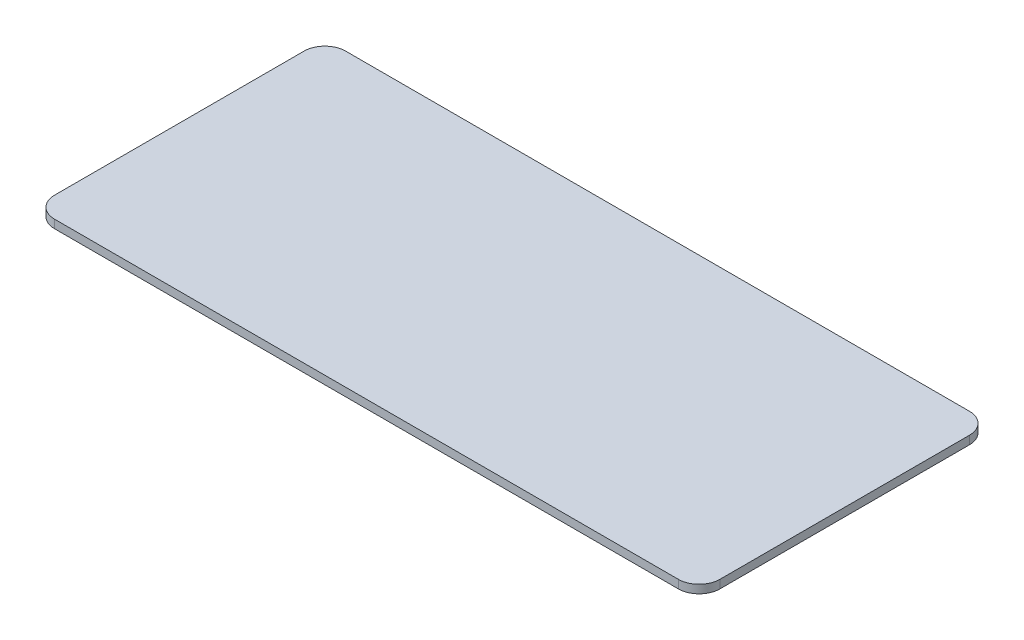
ISO-10303-21;
HEADER;
FILE_DESCRIPTION(('STEP AP214'),'2;1');
FILE_NAME('part.step','',(''),(''),'','','');
FILE_SCHEMA(('AUTOMOTIVE_DESIGN { 1 0 10303 214 1 1 1 1 }'));
ENDSEC;
DATA;
#1=APPLICATION_CONTEXT('core data for automotive mechanical design processes');
#2=APPLICATION_PROTOCOL_DEFINITION('international standard','automotive_design',2000,#1);
#3=PRODUCT_CONTEXT('',#1,'mechanical');
#4=PRODUCT('Part','Part','',(#3));
#5=PRODUCT_RELATED_PRODUCT_CATEGORY('part','',(#4));
#6=PRODUCT_DEFINITION_FORMATION('','',#4);
#7=PRODUCT_DEFINITION_CONTEXT('part definition',#1,'design');
#8=PRODUCT_DEFINITION('design','',#6,#7);
#9=PRODUCT_DEFINITION_SHAPE('','',#8);
#10=(LENGTH_UNIT() NAMED_UNIT(*) SI_UNIT(.MILLI.,.METRE.));
#11=(NAMED_UNIT(*) PLANE_ANGLE_UNIT() SI_UNIT($,.RADIAN.));
#12=(NAMED_UNIT(*) SI_UNIT($,.STERADIAN.) SOLID_ANGLE_UNIT());
#13=UNCERTAINTY_MEASURE_WITH_UNIT(LENGTH_MEASURE(1.E-05),#10,'distance_accuracy_value','');
#14=(GEOMETRIC_REPRESENTATION_CONTEXT(3) GLOBAL_UNCERTAINTY_ASSIGNED_CONTEXT((#13)) GLOBAL_UNIT_ASSIGNED_CONTEXT((#10,
#11,#12)) REPRESENTATION_CONTEXT('',''));
#15=CARTESIAN_POINT('',(0.,0.,0.));
#16=DIRECTION('',(0.,0.,1.));
#17=DIRECTION('',(1.,0.,0.));
#18=AXIS2_PLACEMENT_3D('',#15,#16,#17);
#19=CARTESIAN_POINT('',(0.,48.,0.));
#20=DIRECTION('',(0.,1.,0.));
#21=DIRECTION('',(0.,0.,1.));
#22=AXIS2_PLACEMENT_3D('',#19,#20,#21);
#23=PLANE('',#22);
#24=CARTESIAN_POINT('',(-93.3544303797468,48.,-42.8481012658228));
#25=DIRECTION('',(0.,1.,0.));
#26=DIRECTION('',(0.,0.,1.));
#27=AXIS2_PLACEMENT_3D('',#24,#25,#26);
#28=CIRCLE('',#27,5.);
#29=CARTESIAN_POINT('',(-98.3544303797468,48.,-42.8481012658228));
#30=VERTEX_POINT('',#29);
#31=CARTESIAN_POINT('',(-93.3544303797468,48.,-47.8481012658228));
#32=VERTEX_POINT('',#31);
#33=EDGE_CURVE('E131',#30,#32,#28,.F.);
#34=ORIENTED_EDGE('',*,*,#33,.T.);
#35=DIRECTION('',(-1.,0.,0.));
#36=VECTOR('',#35,1.);
#37=CARTESIAN_POINT('',(-98.3544303797468,48.,-47.8481012658228));
#38=LINE('',#37,#36);
#39=CARTESIAN_POINT('',(56.6455696202532,48.,-47.8481012658228));
#40=VERTEX_POINT('',#39);
#41=EDGE_CURVE('E134',#40,#32,#38,.T.);
#42=ORIENTED_EDGE('',*,*,#41,.F.);
#43=CARTESIAN_POINT('',(56.6455696202532,48.,-42.8481012658228));
#44=DIRECTION('',(0.,1.,0.));
#45=DIRECTION('',(0.,0.,1.));
#46=AXIS2_PLACEMENT_3D('',#43,#44,#45);
#47=CIRCLE('',#46,5.);
#48=CARTESIAN_POINT('',(61.6455696202532,48.,-42.8481012658228));
#49=VERTEX_POINT('',#48);
#50=EDGE_CURVE('E118',#40,#49,#47,.F.);
#51=ORIENTED_EDGE('',*,*,#50,.T.);
#52=DIRECTION('',(0.,0.,-1.));
#53=VECTOR('',#52,1.);
#54=CARTESIAN_POINT('',(61.6455696202532,48.,-47.8481012658228));
#55=LINE('',#54,#53);
#56=CARTESIAN_POINT('',(61.6455696202532,48.,17.1518987341772));
#57=VERTEX_POINT('',#56);
#58=EDGE_CURVE('E114',#57,#49,#55,.T.);
#59=ORIENTED_EDGE('',*,*,#58,.F.);
#60=CARTESIAN_POINT('',(56.6455696202532,48.,17.1518987341772));
#61=DIRECTION('',(0.,1.,0.));
#62=DIRECTION('',(0.,0.,1.));
#63=AXIS2_PLACEMENT_3D('',#60,#61,#62);
#64=CIRCLE('',#63,5.);
#65=CARTESIAN_POINT('',(56.6455696202532,48.,22.1518987341772));
#66=VERTEX_POINT('',#65);
#67=EDGE_CURVE('E39',#57,#66,#64,.F.);
#68=ORIENTED_EDGE('',*,*,#67,.T.);
#69=DIRECTION('',(1.,0.,0.));
#70=VECTOR('',#69,1.);
#71=CARTESIAN_POINT('',(-98.3544303797468,48.,22.1518987341772));
#72=LINE('',#71,#70);
#73=CARTESIAN_POINT('',(-93.3544303797468,48.,22.1518987341772));
#74=VERTEX_POINT('',#73);
#75=EDGE_CURVE('E101',#74,#66,#72,.T.);
#76=ORIENTED_EDGE('',*,*,#75,.F.);
#77=CARTESIAN_POINT('',(-93.3544303797468,48.,17.1518987341772));
#78=DIRECTION('',(0.,1.,0.));
#79=DIRECTION('',(0.,0.,1.));
#80=AXIS2_PLACEMENT_3D('',#77,#78,#79);
#81=CIRCLE('',#80,5.);
#82=CARTESIAN_POINT('',(-98.3544303797468,48.,17.1518987341772));
#83=VERTEX_POINT('',#82);
#84=EDGE_CURVE('E109',#74,#83,#81,.F.);
#85=ORIENTED_EDGE('',*,*,#84,.T.);
#86=DIRECTION('',(0.,0.,1.));
#87=VECTOR('',#86,1.);
#88=CARTESIAN_POINT('',(-98.3544303797468,48.,-47.8481012658228));
#89=LINE('',#88,#87);
#90=EDGE_CURVE('E108',#30,#83,#89,.T.);
#91=ORIENTED_EDGE('',*,*,#90,.F.);
#92=EDGE_LOOP('',(#34,#42,#51,#59,#68,#76,#85,#91));
#93=FACE_BOUND('',#92,.T.);
#94=ADVANCED_FACE('F35',(#93),#23,.F.);
#95=CARTESIAN_POINT('',(-98.3544303797468,50.,22.1518987341772));
#96=DIRECTION('',(0.,0.,-1.));
#97=DIRECTION('',(-1.,0.,0.));
#98=AXIS2_PLACEMENT_3D('',#95,#96,#97);
#99=PLANE('',#98);
#100=DIRECTION('',(0.,-1.,0.));
#101=VECTOR('',#100,1.);
#102=CARTESIAN_POINT('',(-93.3544303797468,50.,22.1518987341772));
#103=LINE('',#102,#101);
#104=CARTESIAN_POINT('',(-93.3544303797468,50.,22.1518987341772));
#105=VERTEX_POINT('',#104);
#106=EDGE_CURVE('E105',#105,#74,#103,.T.);
#107=ORIENTED_EDGE('',*,*,#106,.T.);
#108=ORIENTED_EDGE('',*,*,#75,.T.);
#109=DIRECTION('',(0.,-1.,0.));
#110=VECTOR('',#109,1.);
#111=CARTESIAN_POINT('',(56.6455696202532,50.,22.1518987341772));
#112=LINE('',#111,#110);
#113=CARTESIAN_POINT('',(56.6455696202532,50.,22.1518987341772));
#114=VERTEX_POINT('',#113);
#115=EDGE_CURVE('E58',#66,#114,#112,.F.);
#116=ORIENTED_EDGE('',*,*,#115,.T.);
#117=DIRECTION('',(1.,0.,0.));
#118=VECTOR('',#117,1.);
#119=CARTESIAN_POINT('',(-98.3544303797468,50.,22.1518987341772));
#120=LINE('',#119,#118);
#121=EDGE_CURVE('E44',#105,#114,#120,.T.);
#122=ORIENTED_EDGE('',*,*,#121,.F.);
#123=EDGE_LOOP('',(#107,#108,#116,#122));
#124=FACE_BOUND('',#123,.T.);
#125=ADVANCED_FACE('F103',(#124),#99,.F.);
#126=CARTESIAN_POINT('',(-98.3544303797468,50.,-47.8481012658228));
#127=DIRECTION('',(1.,0.,0.));
#128=DIRECTION('',(0.,0.,-1.));
#129=AXIS2_PLACEMENT_3D('',#126,#127,#128);
#130=PLANE('',#129);
#131=DIRECTION('',(0.,-1.,0.));
#132=VECTOR('',#131,1.);
#133=CARTESIAN_POINT('',(-98.3544303797468,50.,-42.8481012658228));
#134=LINE('',#133,#132);
#135=CARTESIAN_POINT('',(-98.3544303797468,50.,-42.8481012658228));
#136=VERTEX_POINT('',#135);
#137=EDGE_CURVE('E126',#136,#30,#134,.T.);
#138=ORIENTED_EDGE('',*,*,#137,.T.);
#139=ORIENTED_EDGE('',*,*,#90,.T.);
#140=DIRECTION('',(0.,-1.,0.));
#141=VECTOR('',#140,1.);
#142=CARTESIAN_POINT('',(-98.3544303797468,50.,17.1518987341772));
#143=LINE('',#142,#141);
#144=CARTESIAN_POINT('',(-98.3544303797468,50.,17.1518987341772));
#145=VERTEX_POINT('',#144);
#146=EDGE_CURVE('E155',#83,#145,#143,.F.);
#147=ORIENTED_EDGE('',*,*,#146,.T.);
#148=DIRECTION('',(0.,0.,1.));
#149=VECTOR('',#148,1.);
#150=CARTESIAN_POINT('',(-98.3544303797468,50.,-47.8481012658228));
#151=LINE('',#150,#149);
#152=EDGE_CURVE('E11',#136,#145,#151,.T.);
#153=ORIENTED_EDGE('',*,*,#152,.F.);
#154=EDGE_LOOP('',(#138,#139,#147,#153));
#155=FACE_BOUND('',#154,.T.);
#156=ADVANCED_FACE('F160',(#155),#130,.F.);
#157=CARTESIAN_POINT('',(61.6455696202532,50.,-47.8481012658228));
#158=DIRECTION('',(-1.,0.,0.));
#159=DIRECTION('',(0.,0.,1.));
#160=AXIS2_PLACEMENT_3D('',#157,#158,#159);
#161=PLANE('',#160);
#162=DIRECTION('',(0.,-1.,0.));
#163=VECTOR('',#162,1.);
#164=CARTESIAN_POINT('',(61.6455696202532,50.,17.1518987341772));
#165=LINE('',#164,#163);
#166=CARTESIAN_POINT('',(61.6455696202532,50.,17.1518987341772));
#167=VERTEX_POINT('',#166);
#168=EDGE_CURVE('E145',#167,#57,#165,.T.);
#169=ORIENTED_EDGE('',*,*,#168,.T.);
#170=ORIENTED_EDGE('',*,*,#58,.T.);
#171=DIRECTION('',(0.,-1.,0.));
#172=VECTOR('',#171,1.);
#173=CARTESIAN_POINT('',(61.6455696202532,50.,-42.8481012658228));
#174=LINE('',#173,#172);
#175=CARTESIAN_POINT('',(61.6455696202532,50.,-42.8481012658228));
#176=VERTEX_POINT('',#175);
#177=EDGE_CURVE('E139',#49,#176,#174,.F.);
#178=ORIENTED_EDGE('',*,*,#177,.T.);
#179=DIRECTION('',(0.,0.,-1.));
#180=VECTOR('',#179,1.);
#181=CARTESIAN_POINT('',(61.6455696202532,50.,-47.8481012658228));
#182=LINE('',#181,#180);
#183=EDGE_CURVE('E124',#167,#176,#182,.T.);
#184=ORIENTED_EDGE('',*,*,#183,.F.);
#185=EDGE_LOOP('',(#169,#170,#178,#184));
#186=FACE_BOUND('',#185,.T.);
#187=ADVANCED_FACE('F182',(#186),#161,.F.);
#188=CARTESIAN_POINT('',(-98.3544303797468,50.,-47.8481012658228));
#189=DIRECTION('',(0.,0.,1.));
#190=DIRECTION('',(1.,0.,0.));
#191=AXIS2_PLACEMENT_3D('',#188,#189,#190);
#192=PLANE('',#191);
#193=DIRECTION('',(0.,-1.,0.));
#194=VECTOR('',#193,1.);
#195=CARTESIAN_POINT('',(56.6455696202532,50.,-47.8481012658228));
#196=LINE('',#195,#194);
#197=CARTESIAN_POINT('',(56.6455696202532,50.,-47.8481012658228));
#198=VERTEX_POINT('',#197);
#199=EDGE_CURVE('E153',#198,#40,#196,.T.);
#200=ORIENTED_EDGE('',*,*,#199,.T.);
#201=ORIENTED_EDGE('',*,*,#41,.T.);
#202=DIRECTION('',(0.,-1.,0.));
#203=VECTOR('',#202,1.);
#204=CARTESIAN_POINT('',(-93.3544303797468,50.,-47.8481012658228));
#205=LINE('',#204,#203);
#206=CARTESIAN_POINT('',(-93.3544303797468,50.,-47.8481012658228));
#207=VERTEX_POINT('',#206);
#208=EDGE_CURVE('E147',#32,#207,#205,.F.);
#209=ORIENTED_EDGE('',*,*,#208,.T.);
#210=DIRECTION('',(-1.,0.,0.));
#211=VECTOR('',#210,1.);
#212=CARTESIAN_POINT('',(-98.3544303797468,50.,-47.8481012658228));
#213=LINE('',#212,#211);
#214=EDGE_CURVE('E121',#198,#207,#213,.T.);
#215=ORIENTED_EDGE('',*,*,#214,.F.);
#216=EDGE_LOOP('',(#200,#201,#209,#215));
#217=FACE_BOUND('',#216,.T.);
#218=ADVANCED_FACE('F180',(#217),#192,.F.);
#219=CARTESIAN_POINT('',(-93.3544303797468,50.,17.1518987341772));
#220=DIRECTION('',(0.,-1.,0.));
#221=DIRECTION('',(0.,0.,-1.));
#222=AXIS2_PLACEMENT_3D('',#219,#220,#221);
#223=CYLINDRICAL_SURFACE('',#222,5.);
#224=ORIENTED_EDGE('',*,*,#84,.F.);
#225=ORIENTED_EDGE('',*,*,#106,.F.);
#226=CARTESIAN_POINT('',(-93.3544303797468,50.,17.1518987341772));
#227=DIRECTION('',(0.,1.,0.));
#228=DIRECTION('',(0.,0.,1.));
#229=AXIS2_PLACEMENT_3D('',#226,#227,#228);
#230=CIRCLE('',#229,5.);
#231=EDGE_CURVE('E51',#145,#105,#230,.T.);
#232=ORIENTED_EDGE('',*,*,#231,.F.);
#233=ORIENTED_EDGE('',*,*,#146,.F.);
#234=EDGE_LOOP('',(#224,#225,#232,#233));
#235=FACE_BOUND('',#234,.T.);
#236=ADVANCED_FACE('F177',(#235),#223,.T.);
#237=CARTESIAN_POINT('',(-93.3544303797468,50.,-42.8481012658228));
#238=DIRECTION('',(0.,-1.,0.));
#239=DIRECTION('',(0.,0.,-1.));
#240=AXIS2_PLACEMENT_3D('',#237,#238,#239);
#241=CYLINDRICAL_SURFACE('',#240,5.);
#242=ORIENTED_EDGE('',*,*,#33,.F.);
#243=ORIENTED_EDGE('',*,*,#137,.F.);
#244=CARTESIAN_POINT('',(-93.3544303797468,50.,-42.8481012658228));
#245=DIRECTION('',(0.,1.,0.));
#246=DIRECTION('',(0.,0.,1.));
#247=AXIS2_PLACEMENT_3D('',#244,#245,#246);
#248=CIRCLE('',#247,5.);
#249=EDGE_CURVE('E166',#207,#136,#248,.T.);
#250=ORIENTED_EDGE('',*,*,#249,.F.);
#251=ORIENTED_EDGE('',*,*,#208,.F.);
#252=EDGE_LOOP('',(#242,#243,#250,#251));
#253=FACE_BOUND('',#252,.T.);
#254=ADVANCED_FACE('F164',(#253),#241,.T.);
#255=CARTESIAN_POINT('',(56.6455696202532,50.,-42.8481012658228));
#256=DIRECTION('',(0.,-1.,0.));
#257=DIRECTION('',(0.,0.,-1.));
#258=AXIS2_PLACEMENT_3D('',#255,#256,#257);
#259=CYLINDRICAL_SURFACE('',#258,5.);
#260=ORIENTED_EDGE('',*,*,#50,.F.);
#261=ORIENTED_EDGE('',*,*,#199,.F.);
#262=CARTESIAN_POINT('',(56.6455696202532,50.,-42.8481012658228));
#263=DIRECTION('',(0.,1.,0.));
#264=DIRECTION('',(0.,0.,1.));
#265=AXIS2_PLACEMENT_3D('',#262,#263,#264);
#266=CIRCLE('',#265,5.);
#267=EDGE_CURVE('E141',#176,#198,#266,.T.);
#268=ORIENTED_EDGE('',*,*,#267,.F.);
#269=ORIENTED_EDGE('',*,*,#177,.F.);
#270=EDGE_LOOP('',(#260,#261,#268,#269));
#271=FACE_BOUND('',#270,.T.);
#272=ADVANCED_FACE('F140',(#271),#259,.T.);
#273=CARTESIAN_POINT('',(56.6455696202532,50.,17.1518987341772));
#274=DIRECTION('',(0.,-1.,0.));
#275=DIRECTION('',(0.,0.,-1.));
#276=AXIS2_PLACEMENT_3D('',#273,#274,#275);
#277=CYLINDRICAL_SURFACE('',#276,5.);
#278=ORIENTED_EDGE('',*,*,#67,.F.);
#279=ORIENTED_EDGE('',*,*,#168,.F.);
#280=CARTESIAN_POINT('',(56.6455696202532,50.,17.1518987341772));
#281=DIRECTION('',(0.,1.,0.));
#282=DIRECTION('',(0.,0.,1.));
#283=AXIS2_PLACEMENT_3D('',#280,#281,#282);
#284=CIRCLE('',#283,5.);
#285=EDGE_CURVE('E120',#114,#167,#284,.T.);
#286=ORIENTED_EDGE('',*,*,#285,.F.);
#287=ORIENTED_EDGE('',*,*,#115,.F.);
#288=EDGE_LOOP('',(#278,#279,#286,#287));
#289=FACE_BOUND('',#288,.T.);
#290=ADVANCED_FACE('F37',(#289),#277,.T.);
#291=CARTESIAN_POINT('',(0.,50.,0.));
#292=DIRECTION('',(0.,1.,0.));
#293=DIRECTION('',(0.,0.,1.));
#294=AXIS2_PLACEMENT_3D('',#291,#292,#293);
#295=PLANE('',#294);
#296=ORIENTED_EDGE('',*,*,#152,.T.);
#297=ORIENTED_EDGE('',*,*,#231,.T.);
#298=ORIENTED_EDGE('',*,*,#121,.T.);
#299=ORIENTED_EDGE('',*,*,#285,.T.);
#300=ORIENTED_EDGE('',*,*,#183,.T.);
#301=ORIENTED_EDGE('',*,*,#267,.T.);
#302=ORIENTED_EDGE('',*,*,#214,.T.);
#303=ORIENTED_EDGE('',*,*,#249,.T.);
#304=EDGE_LOOP('',(#296,#297,#298,#299,#300,#301,#302,#303));
#305=FACE_BOUND('',#304,.T.);
#306=ADVANCED_FACE('F175',(#305),#295,.T.);
#307=CLOSED_SHELL('',(#94,#125,#156,#187,#218,#236,#254,#272,#290,#306));
#308=MANIFOLD_SOLID_BREP('B2',#307);
#309=ADVANCED_BREP_SHAPE_REPRESENTATION('',(#18,#308),#14);
#310=SHAPE_DEFINITION_REPRESENTATION(#9,#309);
ENDSEC;
END-ISO-10303-21;
